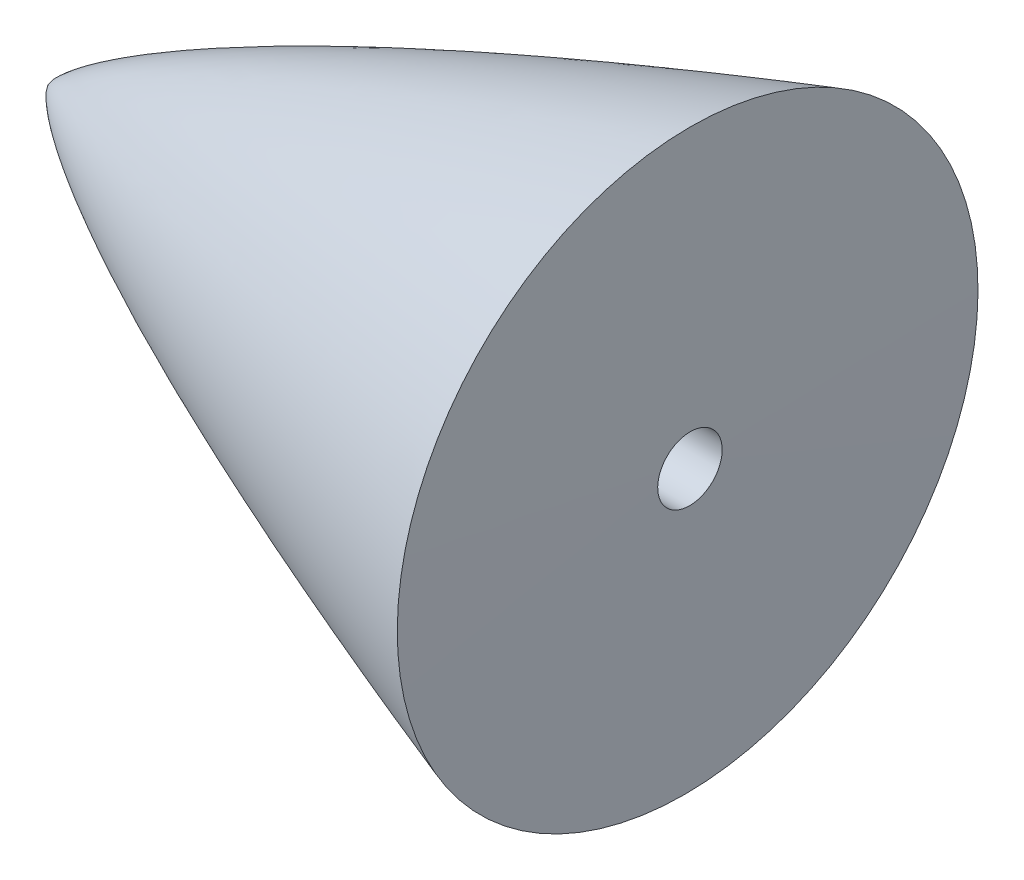
ISO-10303-21;
HEADER;
FILE_DESCRIPTION(('STEP AP214'),'2;1');
FILE_NAME('part.step','',(''),(''),'','','');
FILE_SCHEMA(('AUTOMOTIVE_DESIGN { 1 0 10303 214 1 1 1 1 }'));
ENDSEC;
DATA;
#1=APPLICATION_CONTEXT('core data for automotive mechanical design processes');
#2=APPLICATION_PROTOCOL_DEFINITION('international standard','automotive_design',2000,#1);
#3=PRODUCT_CONTEXT('',#1,'mechanical');
#4=PRODUCT('Part','Part','',(#3));
#5=PRODUCT_RELATED_PRODUCT_CATEGORY('part','',(#4));
#6=PRODUCT_DEFINITION_FORMATION('','',#4);
#7=PRODUCT_DEFINITION_CONTEXT('part definition',#1,'design');
#8=PRODUCT_DEFINITION('design','',#6,#7);
#9=PRODUCT_DEFINITION_SHAPE('','',#8);
#10=(LENGTH_UNIT() NAMED_UNIT(*) SI_UNIT(.MILLI.,.METRE.));
#11=(NAMED_UNIT(*) PLANE_ANGLE_UNIT() SI_UNIT($,.RADIAN.));
#12=(NAMED_UNIT(*) SI_UNIT($,.STERADIAN.) SOLID_ANGLE_UNIT());
#13=UNCERTAINTY_MEASURE_WITH_UNIT(LENGTH_MEASURE(1.E-05),#10,'distance_accuracy_value','');
#14=(GEOMETRIC_REPRESENTATION_CONTEXT(3) GLOBAL_UNCERTAINTY_ASSIGNED_CONTEXT((#13)) GLOBAL_UNIT_ASSIGNED_CONTEXT((#10,
#11,#12)) REPRESENTATION_CONTEXT('',''));
#15=CARTESIAN_POINT('',(0.,0.,0.));
#16=DIRECTION('',(0.,0.,1.));
#17=DIRECTION('',(1.,0.,0.));
#18=AXIS2_PLACEMENT_3D('',#15,#16,#17);
#19=CARTESIAN_POINT('',(50.8000000000005,22.5303567600831,0.));
#20=CARTESIAN_POINT('',(50.3465117854958,22.3812512382409,0.));
#21=CARTESIAN_POINT('',(49.442710434982,22.0829308392967,0.));
#22=CARTESIAN_POINT('',(47.1773804594535,21.3310775343089,0.));
#23=CARTESIAN_POINT('',(44.9449824900996,20.575969254353,0.));
#24=CARTESIAN_POINT('',(42.3170495750487,19.6775947745826,0.));
#25=CARTESIAN_POINT('',(39.9342074399655,18.8455213654888,0.));
#26=CARTESIAN_POINT('',(37.9136867647819,18.1332544680412,0.));
#27=CARTESIAN_POINT('',(35.9736316381102,17.4378758859734,0.));
#28=CARTESIAN_POINT('',(33.9915603629898,16.7185301483629,0.));
#29=CARTESIAN_POINT('',(31.5467375732389,15.8166109871259,0.));
#30=CARTESIAN_POINT('',(28.6052755986588,14.7086926881745,0.));
#31=CARTESIAN_POINT('',(25.195617979637,13.3860362700775,0.));
#32=CARTESIAN_POINT('',(21.3140120710095,11.8194498266795,0.));
#33=CARTESIAN_POINT('',(17.4617236726198,10.1904945755756,0.));
#34=CARTESIAN_POINT('',(13.6413400190153,8.48273894782136,0.));
#35=CARTESIAN_POINT('',(10.0936400641903,6.78232850197087,0.));
#36=CARTESIAN_POINT('',(7.06866265457857,5.20317059368231,0.));
#37=CARTESIAN_POINT('',(4.68834287270004,3.82830118825915,0.));
#38=CARTESIAN_POINT('',(3.03757211642044,2.76626899081453,0.));
#39=CARTESIAN_POINT('',(1.94795210676624,1.98434624807816,0.));
#40=CARTESIAN_POINT('',(1.22079366392824,1.39852484429859,0.));
#41=CARTESIAN_POINT('',(0.755145997118583,0.975924582867757,0.));
#42=CARTESIAN_POINT('',(0.461319422784189,0.674703687613275,0.));
#43=CARTESIAN_POINT('',(0.27829904475557,0.462127291497044,0.));
#44=CARTESIAN_POINT('',(0.165033444135209,0.312533910105992,0.));
#45=CARTESIAN_POINT('',(0.0968927723109344,0.209644328942817,0.));
#46=CARTESIAN_POINT('',(0.0563614371928829,0.139758552997633,0.));
#47=CARTESIAN_POINT('',(0.0275961366881815,0.0824356831018831,0.));
#48=CARTESIAN_POINT('',(0.0110726757431305,0.0442783153926129,0.));
#49=CARTESIAN_POINT('',(0.00340240039888783,0.0179503095970332,0.));
#50=CARTESIAN_POINT('',(0.,0.,0.));
#51=B_SPLINE_CURVE_WITH_KNOTS('',4,(#19,#20,#21,#22,#23,#24,#25,#26,#27,#28,#29,#30,#31,#32,#33,
#34,#35,#36,#37,#38,#39,#40,#41,#42,#43,#44,#45,#46,#47,#48,#49,#50),.UNSPECIFIED.,.F.,.F.,(5,1,
1,1,1,1,1,1,1,1,1,1,1,1,1,1,1,1,1,1,1,1,1,1,1,1,1,1,5),(0.,0.0341314652764168,
0.0682629305528335,0.136525859872037,0.170657325419194,0.204788790966351,0.238920256000712,
0.273051721035072,0.307183186492675,0.341314651950278,0.409577581686297,0.477840513795889,
0.546103441195251,0.614366380584495,0.682629290321098,0.750892221684726,0.802872165882953,
0.837003519315032,0.861991327744609,0.878950290734606,0.890368845138298,0.897914284738923,
0.903010842763492,0.906396837152728,0.908666277387763,0.910152012468246,0.911061650965127,
0.911664755719932,0.912854294796394),.UNSPECIFIED.);
#52=CARTESIAN_POINT('',(0.,0.,0.));
#53=DIRECTION('',(-0.999958208555171,0.00914227231782461,0.));
#54=AXIS1_PLACEMENT('',#52,#53);
#55=SURFACE_OF_REVOLUTION('',#51,#54);
#56=CARTESIAN_POINT('',(0.,0.,0.));
#57=VERTEX_POINT('',#56);
#58=VERTEX_LOOP('',#57);
#59=FACE_BOUND('',#58,.T.);
#60=CARTESIAN_POINT('',(50.5897840291561,-0.462524911678808,0.));
#61=DIRECTION('',(-0.999958208555171,0.00914227231782461,0.));
#62=DIRECTION('',(-0.00914227231782461,-0.999958208555171,0.));
#63=AXIS2_PLACEMENT_3D('',#60,#61,#62);
#64=CIRCLE('',#63,22.9938426176679);
#65=CARTESIAN_POINT('',(50.3795680583122,-23.4554065834416,0.));
#66=VERTEX_POINT('',#65);
#67=EDGE_CURVE('E11',#66,#66,#64,.T.);
#68=ORIENTED_EDGE('',*,*,#67,.T.);
#69=EDGE_LOOP('',(#68));
#70=FACE_BOUND('',#69,.T.);
#71=ADVANCED_FACE('F37',(#59,#70),#55,.T.);
#72=CARTESIAN_POINT('',(50.8,-0.464446843650133,0.));
#73=DIRECTION('',(-0.999958208555171,0.00914227231782461,0.));
#74=DIRECTION('',(-0.00914227231782461,-0.999958208555171,0.));
#75=AXIS2_PLACEMENT_3D('',#72,#73,#74);
#76=CONICAL_SURFACE('',#75,0.,1.56165392711869);
#77=CARTESIAN_POINT('',(50.7514405421361,-2.8563607226494,-1.67309737151764));
#78=CARTESIAN_POINT('',(50.7505841296063,-2.93717644828396,-1.57996674634571));
#79=CARTESIAN_POINT('',(50.7497999914759,-3.0112448269136,-1.48095453308958));
#80=CARTESIAN_POINT('',(50.7483918364705,-3.14434196213453,-1.27322399619832));
#81=CARTESIAN_POINT('',(50.7477679273403,-3.20336059846426,-1.16449920729777));
#82=CARTESIAN_POINT('',(50.7466057086025,-3.31334988802808,-0.921314581499885));
#83=CARTESIAN_POINT('',(50.7460978129312,-3.36145155301971,-0.785544776739851));
#84=CARTESIAN_POINT('',(50.7453300437503,-3.43418368507806,-0.507834177241092));
#85=CARTESIAN_POINT('',(50.7450702469713,-3.45880689084645,-0.365891487566549));
#86=CARTESIAN_POINT('',(50.7448057920375,-3.48387156345968,-0.0799014478196097));
#87=CARTESIAN_POINT('',(50.7448010978481,-3.48431644563201,0.0641456021243835));
#88=CARTESIAN_POINT('',(50.7450469209896,-3.46101689460632,0.350258514592375));
#89=CARTESIAN_POINT('',(50.7452974210271,-3.43727410051355,0.492324510703438));
#90=CARTESIAN_POINT('',(50.7460468579,-3.36627614746372,0.770457492977118));
#91=CARTESIAN_POINT('',(50.7465458001838,-3.31902047285333,0.906524347503266));
#92=CARTESIAN_POINT('',(50.7477786897789,-3.20233712506413,1.1687944924581));
#93=CARTESIAN_POINT('',(50.7485126399295,-3.13290918399867,1.29499766369024));
#94=CARTESIAN_POINT('',(50.750195741857,-2.97385199080143,1.53395743819739));
#95=CARTESIAN_POINT('',(50.7511448953963,-2.88422257323608,1.64671393134356));
#96=CARTESIAN_POINT('',(50.7532327267643,-2.68730735192309,1.85557852297479));
#97=CARTESIAN_POINT('',(50.7543714043865,-2.58002156741731,1.95168663960299));
#98=CARTESIAN_POINT('',(50.7568074220661,-2.35083594899108,2.12452926041214));
#99=CARTESIAN_POINT('',(50.7581047664778,-2.22893571401386,2.20126323273895));
#100=CARTESIAN_POINT('',(50.760822738251,-1.97398398516981,2.33317622345662));
#101=CARTESIAN_POINT('',(50.762243365602,-1.84093249226144,2.38835524370014));
#102=CARTESIAN_POINT('',(50.7651690080239,-1.5674512544145,2.47559350262932));
#103=CARTESIAN_POINT('',(50.7666740254057,-1.42702130743919,2.50765210787772));
#104=CARTESIAN_POINT('',(50.7697268528401,-1.1427727960002,2.54773717917423));
#105=CARTESIAN_POINT('',(50.7712746629065,-0.998954230452183,2.55576363753201));
#106=CARTESIAN_POINT('',(50.7743699459872,-0.71200874272283,2.54755650421177));
#107=CARTESIAN_POINT('',(50.775917418996,-0.568881831264569,2.53132253761456));
#108=CARTESIAN_POINT('',(50.7789683341685,-0.287384878091102,2.47505459583576));
#109=CARTESIAN_POINT('',(50.7804717763354,-0.14901483600634,2.43502062250318));
#110=CARTESIAN_POINT('',(50.783391563577,0.119039977201063,2.33228908134673));
#111=CARTESIAN_POINT('',(50.7848079089063,0.248724773729573,2.26959157982109));
#112=CARTESIAN_POINT('',(50.7875122146572,0.495727951831481,2.12331255418964));
#113=CARTESIAN_POINT('',(50.7888001750867,0.613046334163073,2.03973103136424));
#114=CARTESIAN_POINT('',(50.7912093679939,0.831983912251609,1.85405824893232));
#115=CARTESIAN_POINT('',(50.7923306036718,0.933603409336896,1.75196734468127));
#116=CARTESIAN_POINT('',(50.7943722741747,1.11826091675125,1.53217267803711));
#117=CARTESIAN_POINT('',(50.7952927090251,1.20129892942495,1.41446891761403));
#118=CARTESIAN_POINT('',(50.7969041299064,1.34643400938606,1.16679308611396));
#119=CARTESIAN_POINT('',(50.7975951219003,1.40853162089923,1.03682133398551));
#120=CARTESIAN_POINT('',(50.798725756223,1.51002585460792,0.768296497331849));
#121=CARTESIAN_POINT('',(50.7991653986015,1.54942248129365,0.629743414504022));
#122=CARTESIAN_POINT('',(50.7997791458669,1.60439561948354,0.347992254853583));
#123=CARTESIAN_POINT('',(50.7999532565197,1.61997264820911,0.204794278959652));
#124=CARTESIAN_POINT('',(50.8000302896833,1.62686598052559,-0.0821845241689591));
#125=CARTESIAN_POINT('',(50.7999332121534,1.61818228046272,-0.225965351491416));
#126=CARTESIAN_POINT('',(50.7994710355171,1.57680087554434,-0.51002693822133));
#127=CARTESIAN_POINT('',(50.7991059388479,1.5441033890596,-0.650307729444577));
#128=CARTESIAN_POINT('',(50.7981195435379,1.45562297875133,-0.923388415893206));
#129=CARTESIAN_POINT('',(50.797498245045,1.39984006824768,-1.05618831543488));
#130=CARTESIAN_POINT('',(50.7960192634217,1.26677207346667,-1.31053841210268));
#131=CARTESIAN_POINT('',(50.7951615789097,1.18948686350622,-1.43208854346725));
#132=CARTESIAN_POINT('',(50.7932366622785,1.01560836555483,-1.66048814500519));
#133=CARTESIAN_POINT('',(50.7921694299369,0.919015057071859,-1.76733759957627));
#134=CARTESIAN_POINT('',(50.7898580625002,0.709260548474779,-1.96330473851638));
#135=CARTESIAN_POINT('',(50.7886139241571,0.596099044164108,-2.05242209724845));
#136=CARTESIAN_POINT('',(50.7859859986975,0.356421665642527,-2.21039326844494));
#137=CARTESIAN_POINT('',(50.784602211386,0.229905772775997,-2.27924705260134));
#138=CARTESIAN_POINT('',(50.7817355009982,-0.0328937334359094,-2.39473890699881));
#139=CARTESIAN_POINT('',(50.7802525742996,-0.169177703711857,-2.44137616495998));
#140=CARTESIAN_POINT('',(50.7772303383731,-0.447637605633375,-2.51110662647389));
#141=CARTESIAN_POINT('',(50.7756910304018,-0.589813405970441,-2.53420035443711));
#142=CARTESIAN_POINT('',(50.7725996730609,-0.876018124931123,-2.5561903964113));
#143=CARTESIAN_POINT('',(50.7710476241695,-1.02004697412152,-2.555087614435));
#144=CARTESIAN_POINT('',(50.7679738900274,-1.30589761932847,-2.52871413308505));
#145=CARTESIAN_POINT('',(50.766452209071,-1.44771910258231,-2.50344003998413));
#146=CARTESIAN_POINT('',(50.7634812531531,-1.72513713601805,-2.42943435243064));
#147=CARTESIAN_POINT('',(50.7620319982157,-1.86073196383362,-2.38069630987818));
#148=CARTESIAN_POINT('',(50.7592467589207,-2.12174821695429,-2.26115419788496));
#149=CARTESIAN_POINT('',(50.7579106986294,-2.24717645976485,-2.19036507233279));
#150=CARTESIAN_POINT('',(50.7556843623932,-2.45646721697127,-2.0477794889763));
#151=CARTESIAN_POINT('',(50.7547630356315,-2.54317810167351,-1.98011485967064));
#152=CARTESIAN_POINT('',(50.7530222606583,-2.70715890829395,-1.83421639255701));
#153=CARTESIAN_POINT('',(50.7522027751768,-2.78443228379029,-1.75598644324214));
#154=CARTESIAN_POINT('',(50.7514405421361,-2.8563607226494,-1.67309737151764));
#155=B_SPLINE_CURVE_WITH_KNOTS('',3,(#77,#78,#79,#80,#81,#82,#83,#84,#85,#86,#87,#88,#89,#90,
#91,#92,#93,#94,#95,#96,#97,#98,#99,#100,#101,#102,#103,#104,#105,#106,#107,#108,#109,#110,#111,
#112,#113,#114,#115,#116,#117,#118,#119,#120,#121,#122,#123,#124,#125,#126,#127,#128,#129,#130,
#131,#132,#133,#134,#135,#136,#137,#138,#139,#140,#141,#142,#143,#144,#145,#146,#147,#148,#149,
#150,#151,#152,#153,#154),.UNSPECIFIED.,.T.,.F.,(4,2,2,2,2,2,2,2,2,2,2,2,2,2,2,2,2,2,2,2,2,2,2,
2,2,2,2,2,2,2,2,2,2,2,2,2,2,2,4),(0.,0.369632563386502,0.739513036116207,1.16953616373014,
1.5996922436114,2.02978756131045,2.45985373505214,2.88992934085102,3.32001014304574,
3.75009446737823,4.18017832300873,4.61027398390967,5.04036960784349,5.4704770147944,
5.90058455938061,6.33069875089244,6.76081290898901,7.19092580887117,7.62103868238282,
8.05114329917403,8.4812478616942,8.91134124524869,9.34143454373154,9.77151850298799,
10.2016025270172,10.6316826401007,11.0617625050359,11.4918448838836,11.9219277191876,
12.3520184519193,12.7821097854809,13.212216842821,13.6423143197127,14.0723957276371,
14.5025375291954,14.9327976050409,15.3627667282158,15.6918716799444,16.020855835282),.UNSPECIFIED.);
#156=CARTESIAN_POINT('',(50.7514405421361,-2.8563607226494,-1.67309737151764));
#157=VERTEX_POINT('',#156);
#158=EDGE_CURVE('E41',#157,#157,#155,.T.);
#159=ORIENTED_EDGE('',*,*,#158,.T.);
#160=EDGE_LOOP('',(#159));
#161=FACE_BOUND('',#160,.T.);
#162=ORIENTED_EDGE('',*,*,#67,.F.);
#163=EDGE_LOOP('',(#162));
#164=FACE_BOUND('',#163,.T.);
#165=ADVANCED_FACE('F73',(#161,#164),#76,.T.);
#166=CARTESIAN_POINT('',(50.7915081558575,-0.928816049304032,3.5291796143131E-06));
#167=DIRECTION('',(0.999832837713736,-0.0182837804978471,6.94720396487991E-08));
#168=DIRECTION('',(0.0182837804978471,0.999832837713738,0.));
#169=AXIS2_PLACEMENT_3D('',#166,#167,#168);
#170=CYLINDRICAL_SURFACE('',#169,2.55269999999999);
#171=CARTESIAN_POINT('',(25.3957540779286,-0.464408024658716,1.7645898072336E-06));
#172=DIRECTION('',(0.999832837713736,-0.0182837804978471,6.94720396487991E-08));
#173=DIRECTION('',(0.0182837804978471,0.999832837713738,0.));
#174=AXIS2_PLACEMENT_3D('',#171,#172,#173);
#175=CIRCLE('',#174,2.5527);
#176=CARTESIAN_POINT('',(25.4424270844055,2.08786526017314,1.7645898072336E-06));
#177=VERTEX_POINT('',#176);
#178=EDGE_CURVE('E61',#177,#177,#175,.T.);
#179=ORIENTED_EDGE('',*,*,#178,.F.);
#180=EDGE_LOOP('',(#179));
#181=FACE_BOUND('',#180,.T.);
#182=ORIENTED_EDGE('',*,*,#158,.F.);
#183=EDGE_LOOP('',(#182));
#184=FACE_BOUND('',#183,.T.);
#185=ADVANCED_FACE('F57',(#181,#184),#170,.F.);
#186=CARTESIAN_POINT('',(25.3957540779286,-0.464408024658716,1.7645898072336E-06));
#187=DIRECTION('',(0.999832837713736,-0.0182837804978471,6.94720396487991E-08));
#188=DIRECTION('',(0.0182837804978471,0.999832837713738,0.));
#189=AXIS2_PLACEMENT_3D('',#186,#187,#188);
#190=CONICAL_SURFACE('',#189,2.5527,1.02974425867665);
#191=CARTESIAN_POINT('',(23.862193572077,-0.436364053095161,1.65803241392623E-06));
#192=VERTEX_POINT('',#191);
#193=VERTEX_LOOP('',#192);
#194=FACE_BOUND('',#193,.T.);
#195=ORIENTED_EDGE('',*,*,#178,.T.);
#196=EDGE_LOOP('',(#195));
#197=FACE_BOUND('',#196,.T.);
#198=ADVANCED_FACE('F54',(#194,#197),#190,.F.);
#199=CLOSED_SHELL('',(#71,#165,#185,#198));
#200=MANIFOLD_SOLID_BREP('B2',#199);
#201=ADVANCED_BREP_SHAPE_REPRESENTATION('',(#18,#200),#14);
#202=SHAPE_DEFINITION_REPRESENTATION(#9,#201);
ENDSEC;
END-ISO-10303-21;
